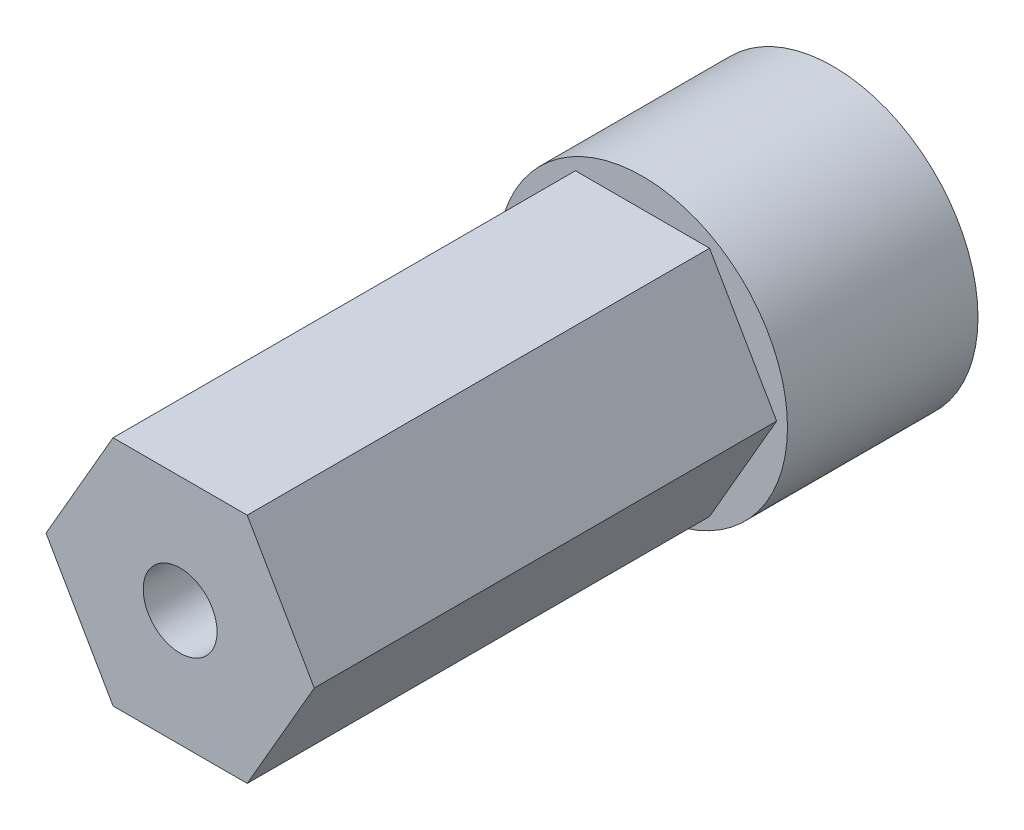
ISO-10303-21;
HEADER;
FILE_DESCRIPTION(('STEP AP214'),'2;1');
FILE_NAME('part.step','',(''),(''),'','','');
FILE_SCHEMA(('AUTOMOTIVE_DESIGN { 1 0 10303 214 1 1 1 1 }'));
ENDSEC;
DATA;
#1=APPLICATION_CONTEXT('core data for automotive mechanical design processes');
#2=APPLICATION_PROTOCOL_DEFINITION('international standard','automotive_design',2000,#1);
#3=PRODUCT_CONTEXT('',#1,'mechanical');
#4=PRODUCT('Part','Part','',(#3));
#5=PRODUCT_RELATED_PRODUCT_CATEGORY('part','',(#4));
#6=PRODUCT_DEFINITION_FORMATION('','',#4);
#7=PRODUCT_DEFINITION_CONTEXT('part definition',#1,'design');
#8=PRODUCT_DEFINITION('design','',#6,#7);
#9=PRODUCT_DEFINITION_SHAPE('','',#8);
#10=(LENGTH_UNIT() NAMED_UNIT(*) SI_UNIT(.MILLI.,.METRE.));
#11=(NAMED_UNIT(*) PLANE_ANGLE_UNIT() SI_UNIT($,.RADIAN.));
#12=(NAMED_UNIT(*) SI_UNIT($,.STERADIAN.) SOLID_ANGLE_UNIT());
#13=UNCERTAINTY_MEASURE_WITH_UNIT(LENGTH_MEASURE(1.E-05),#10,'distance_accuracy_value','');
#14=(GEOMETRIC_REPRESENTATION_CONTEXT(3) GLOBAL_UNCERTAINTY_ASSIGNED_CONTEXT((#13)) GLOBAL_UNIT_ASSIGNED_CONTEXT((#10,
#11,#12)) REPRESENTATION_CONTEXT('',''));
#15=CARTESIAN_POINT('',(0.,0.,0.));
#16=DIRECTION('',(0.,0.,1.));
#17=DIRECTION('',(1.,0.,0.));
#18=AXIS2_PLACEMENT_3D('',#15,#16,#17);
#19=CARTESIAN_POINT('',(0.,0.,10.414));
#20=DIRECTION('',(0.,0.,-1.));
#21=DIRECTION('',(-1.,0.,0.));
#22=AXIS2_PLACEMENT_3D('',#19,#20,#21);
#23=CYLINDRICAL_SURFACE('',#22,7.9248);
#24=CARTESIAN_POINT('',(0.,0.,10.414));
#25=DIRECTION('',(0.,0.,1.));
#26=DIRECTION('',(1.,0.,0.));
#27=AXIS2_PLACEMENT_3D('',#24,#25,#26);
#28=CIRCLE('',#27,7.9248);
#29=CARTESIAN_POINT('',(7.9248,0.,10.414));
#30=VERTEX_POINT('',#29);
#31=EDGE_CURVE('E11',#30,#30,#28,.T.);
#32=ORIENTED_EDGE('',*,*,#31,.F.);
#33=EDGE_LOOP('',(#32));
#34=FACE_BOUND('',#33,.T.);
#35=CARTESIAN_POINT('',(0.,0.,0.));
#36=DIRECTION('',(0.,0.,1.));
#37=DIRECTION('',(1.,0.,0.));
#38=AXIS2_PLACEMENT_3D('',#35,#36,#37);
#39=CIRCLE('',#38,7.9248);
#40=CARTESIAN_POINT('',(7.9248,0.,0.));
#41=VERTEX_POINT('',#40);
#42=EDGE_CURVE('E44',#41,#41,#39,.T.);
#43=ORIENTED_EDGE('',*,*,#42,.T.);
#44=EDGE_LOOP('',(#43));
#45=FACE_BOUND('',#44,.T.);
#46=ADVANCED_FACE('F41',(#34,#45),#23,.T.);
#47=CARTESIAN_POINT('',(0.,0.,10.414));
#48=DIRECTION('',(0.,0.,1.));
#49=DIRECTION('',(1.,0.,0.));
#50=AXIS2_PLACEMENT_3D('',#47,#48,#49);
#51=PLANE('',#50);
#52=DIRECTION('',(1.,0.,0.));
#53=VECTOR('',#52,1.);
#54=CARTESIAN_POINT('',(0.,-6.35,10.414));
#55=LINE('',#54,#53);
#56=CARTESIAN_POINT('',(-3.66617420935412,-6.35,10.414));
#57=VERTEX_POINT('',#56);
#58=CARTESIAN_POINT('',(3.66617420935413,-6.35,10.414));
#59=VERTEX_POINT('',#58);
#60=EDGE_CURVE('E56',#57,#59,#55,.T.);
#61=ORIENTED_EDGE('',*,*,#60,.F.);
#62=DIRECTION('',(0.5,-0.866025403784439,0.));
#63=VECTOR('',#62,1.);
#64=CARTESIAN_POINT('',(-5.49926131403118,-3.175,10.414));
#65=LINE('',#64,#63);
#66=CARTESIAN_POINT('',(-7.33234841870825,0.,10.414));
#67=VERTEX_POINT('',#66);
#68=EDGE_CURVE('E60',#67,#57,#65,.T.);
#69=ORIENTED_EDGE('',*,*,#68,.F.);
#70=DIRECTION('',(-0.5,-0.866025403784439,0.));
#71=VECTOR('',#70,1.);
#72=CARTESIAN_POINT('',(-5.49926131403119,3.175,10.414));
#73=LINE('',#72,#71);
#74=CARTESIAN_POINT('',(-3.66617420935412,6.35,10.414));
#75=VERTEX_POINT('',#74);
#76=EDGE_CURVE('E140',#75,#67,#73,.T.);
#77=ORIENTED_EDGE('',*,*,#76,.F.);
#78=DIRECTION('',(-1.,0.,0.));
#79=VECTOR('',#78,1.);
#80=CARTESIAN_POINT('',(0.,6.35,10.414));
#81=LINE('',#80,#79);
#82=CARTESIAN_POINT('',(3.66617420935412,6.35,10.414));
#83=VERTEX_POINT('',#82);
#84=EDGE_CURVE('E143',#83,#75,#81,.T.);
#85=ORIENTED_EDGE('',*,*,#84,.F.);
#86=DIRECTION('',(-0.5,0.866025403784439,0.));
#87=VECTOR('',#86,1.);
#88=CARTESIAN_POINT('',(5.49926131403119,3.175,10.414));
#89=LINE('',#88,#87);
#90=CARTESIAN_POINT('',(7.33234841870825,0.,10.414));
#91=VERTEX_POINT('',#90);
#92=EDGE_CURVE('E147',#91,#83,#89,.T.);
#93=ORIENTED_EDGE('',*,*,#92,.F.);
#94=DIRECTION('',(0.499999999999999,0.866025403784439,0.));
#95=VECTOR('',#94,1.);
#96=CARTESIAN_POINT('',(5.49926131403119,-3.17499999999999,10.414));
#97=LINE('',#96,#95);
#98=EDGE_CURVE('E151',#59,#91,#97,.T.);
#99=ORIENTED_EDGE('',*,*,#98,.F.);
#100=EDGE_LOOP('',(#61,#69,#77,#85,#93,#99));
#101=FACE_BOUND('',#100,.T.);
#102=ORIENTED_EDGE('',*,*,#31,.T.);
#103=EDGE_LOOP('',(#102));
#104=FACE_BOUND('',#103,.T.);
#105=ADVANCED_FACE('F193',(#101,#104),#51,.T.);
#106=CARTESIAN_POINT('',(0.,0.,0.));
#107=DIRECTION('',(0.,0.,1.));
#108=DIRECTION('',(1.,0.,0.));
#109=AXIS2_PLACEMENT_3D('',#106,#107,#108);
#110=PLANE('',#109);
#111=ORIENTED_EDGE('',*,*,#42,.F.);
#112=EDGE_LOOP('',(#111));
#113=FACE_BOUND('',#112,.T.);
#114=ADVANCED_FACE('F198',(#113),#110,.F.);
#115=CARTESIAN_POINT('',(0.,-6.35,35.687));
#116=DIRECTION('',(0.,1.,0.));
#117=DIRECTION('',(-1.,0.,0.));
#118=AXIS2_PLACEMENT_3D('',#115,#116,#117);
#119=PLANE('',#118);
#120=ORIENTED_EDGE('',*,*,#60,.T.);
#121=DIRECTION('',(0.,0.,-1.));
#122=VECTOR('',#121,1.);
#123=CARTESIAN_POINT('',(3.66617420935413,-6.35,35.687));
#124=LINE('',#123,#122);
#125=CARTESIAN_POINT('',(3.66617420935413,-6.35,35.687));
#126=VERTEX_POINT('',#125);
#127=EDGE_CURVE('E97',#126,#59,#124,.T.);
#128=ORIENTED_EDGE('',*,*,#127,.F.);
#129=DIRECTION('',(1.,0.,0.));
#130=VECTOR('',#129,1.);
#131=CARTESIAN_POINT('',(0.,-6.35,35.687));
#132=LINE('',#131,#130);
#133=CARTESIAN_POINT('',(-3.66617420935412,-6.35,35.687));
#134=VERTEX_POINT('',#133);
#135=EDGE_CURVE('E104',#134,#126,#132,.T.);
#136=ORIENTED_EDGE('',*,*,#135,.F.);
#137=DIRECTION('',(0.,0.,-1.));
#138=VECTOR('',#137,1.);
#139=CARTESIAN_POINT('',(-3.66617420935412,-6.35,35.687));
#140=LINE('',#139,#138);
#141=EDGE_CURVE('E135',#134,#57,#140,.T.);
#142=ORIENTED_EDGE('',*,*,#141,.T.);
#143=EDGE_LOOP('',(#120,#128,#136,#142));
#144=FACE_BOUND('',#143,.T.);
#145=ADVANCED_FACE('F115',(#144),#119,.F.);
#146=CARTESIAN_POINT('',(5.49926131403119,-3.17499999999999,35.687));
#147=DIRECTION('',(-0.866025403784439,0.499999999999999,0.));
#148=DIRECTION('',(-0.499999999999999,-0.866025403784439,0.));
#149=AXIS2_PLACEMENT_3D('',#146,#147,#148);
#150=PLANE('',#149);
#151=ORIENTED_EDGE('',*,*,#98,.T.);
#152=DIRECTION('',(0.,0.,-1.));
#153=VECTOR('',#152,1.);
#154=CARTESIAN_POINT('',(7.33234841870825,0.,35.687));
#155=LINE('',#154,#153);
#156=CARTESIAN_POINT('',(7.33234841870825,0.,35.687));
#157=VERTEX_POINT('',#156);
#158=EDGE_CURVE('E99',#157,#91,#155,.T.);
#159=ORIENTED_EDGE('',*,*,#158,.F.);
#160=DIRECTION('',(0.499999999999999,0.866025403784439,0.));
#161=VECTOR('',#160,1.);
#162=CARTESIAN_POINT('',(5.49926131403119,-3.17499999999999,35.687));
#163=LINE('',#162,#161);
#164=EDGE_CURVE('E92',#126,#157,#163,.T.);
#165=ORIENTED_EDGE('',*,*,#164,.F.);
#166=ORIENTED_EDGE('',*,*,#127,.T.);
#167=EDGE_LOOP('',(#151,#159,#165,#166));
#168=FACE_BOUND('',#167,.T.);
#169=ADVANCED_FACE('F95',(#168),#150,.F.);
#170=CARTESIAN_POINT('',(5.49926131403119,3.175,35.687));
#171=DIRECTION('',(-0.866025403784439,-0.5,0.));
#172=DIRECTION('',(0.5,-0.866025403784439,0.));
#173=AXIS2_PLACEMENT_3D('',#170,#171,#172);
#174=PLANE('',#173);
#175=ORIENTED_EDGE('',*,*,#92,.T.);
#176=DIRECTION('',(0.,0.,-1.));
#177=VECTOR('',#176,1.);
#178=CARTESIAN_POINT('',(3.66617420935412,6.35,35.687));
#179=LINE('',#178,#177);
#180=CARTESIAN_POINT('',(3.66617420935412,6.35,35.687));
#181=VERTEX_POINT('',#180);
#182=EDGE_CURVE('E121',#181,#83,#179,.T.);
#183=ORIENTED_EDGE('',*,*,#182,.F.);
#184=DIRECTION('',(-0.5,0.866025403784439,0.));
#185=VECTOR('',#184,1.);
#186=CARTESIAN_POINT('',(5.49926131403119,3.175,35.687));
#187=LINE('',#186,#185);
#188=EDGE_CURVE('E103',#157,#181,#187,.T.);
#189=ORIENTED_EDGE('',*,*,#188,.F.);
#190=ORIENTED_EDGE('',*,*,#158,.T.);
#191=EDGE_LOOP('',(#175,#183,#189,#190));
#192=FACE_BOUND('',#191,.T.);
#193=ADVANCED_FACE('F212',(#192),#174,.F.);
#194=CARTESIAN_POINT('',(0.,6.35,35.687));
#195=DIRECTION('',(0.,-1.,0.));
#196=DIRECTION('',(1.,0.,0.));
#197=AXIS2_PLACEMENT_3D('',#194,#195,#196);
#198=PLANE('',#197);
#199=ORIENTED_EDGE('',*,*,#84,.T.);
#200=DIRECTION('',(0.,0.,-1.));
#201=VECTOR('',#200,1.);
#202=CARTESIAN_POINT('',(-3.66617420935412,6.35,35.687));
#203=LINE('',#202,#201);
#204=CARTESIAN_POINT('',(-3.66617420935412,6.35,35.687));
#205=VERTEX_POINT('',#204);
#206=EDGE_CURVE('E127',#205,#75,#203,.T.);
#207=ORIENTED_EDGE('',*,*,#206,.F.);
#208=DIRECTION('',(-1.,0.,0.));
#209=VECTOR('',#208,1.);
#210=CARTESIAN_POINT('',(0.,6.35,35.687));
#211=LINE('',#210,#209);
#212=EDGE_CURVE('E162',#181,#205,#211,.T.);
#213=ORIENTED_EDGE('',*,*,#212,.F.);
#214=ORIENTED_EDGE('',*,*,#182,.T.);
#215=EDGE_LOOP('',(#199,#207,#213,#214));
#216=FACE_BOUND('',#215,.T.);
#217=ADVANCED_FACE('F215',(#216),#198,.F.);
#218=CARTESIAN_POINT('',(-5.49926131403119,3.175,35.687));
#219=DIRECTION('',(0.866025403784439,-0.5,0.));
#220=DIRECTION('',(0.5,0.866025403784439,0.));
#221=AXIS2_PLACEMENT_3D('',#218,#219,#220);
#222=PLANE('',#221);
#223=ORIENTED_EDGE('',*,*,#76,.T.);
#224=DIRECTION('',(0.,0.,-1.));
#225=VECTOR('',#224,1.);
#226=CARTESIAN_POINT('',(-7.33234841870825,0.,35.687));
#227=LINE('',#226,#225);
#228=CARTESIAN_POINT('',(-7.33234841870825,0.,35.687));
#229=VERTEX_POINT('',#228);
#230=EDGE_CURVE('E131',#229,#67,#227,.T.);
#231=ORIENTED_EDGE('',*,*,#230,.F.);
#232=DIRECTION('',(-0.5,-0.866025403784439,0.));
#233=VECTOR('',#232,1.);
#234=CARTESIAN_POINT('',(-5.49926131403119,3.175,35.687));
#235=LINE('',#234,#233);
#236=EDGE_CURVE('E159',#205,#229,#235,.T.);
#237=ORIENTED_EDGE('',*,*,#236,.F.);
#238=ORIENTED_EDGE('',*,*,#206,.T.);
#239=EDGE_LOOP('',(#223,#231,#237,#238));
#240=FACE_BOUND('',#239,.T.);
#241=ADVANCED_FACE('F189',(#240),#222,.F.);
#242=CARTESIAN_POINT('',(-5.49926131403118,-3.175,35.687));
#243=DIRECTION('',(0.866025403784438,0.5,0.));
#244=DIRECTION('',(-0.5,0.866025403784439,0.));
#245=AXIS2_PLACEMENT_3D('',#242,#243,#244);
#246=PLANE('',#245);
#247=ORIENTED_EDGE('',*,*,#68,.T.);
#248=ORIENTED_EDGE('',*,*,#141,.F.);
#249=DIRECTION('',(0.5,-0.866025403784439,0.));
#250=VECTOR('',#249,1.);
#251=CARTESIAN_POINT('',(-5.49926131403118,-3.175,35.687));
#252=LINE('',#251,#250);
#253=EDGE_CURVE('E109',#229,#134,#252,.T.);
#254=ORIENTED_EDGE('',*,*,#253,.F.);
#255=ORIENTED_EDGE('',*,*,#230,.T.);
#256=EDGE_LOOP('',(#247,#248,#254,#255));
#257=FACE_BOUND('',#256,.T.);
#258=ADVANCED_FACE('F184',(#257),#246,.F.);
#259=CARTESIAN_POINT('',(0.,0.,35.687));
#260=DIRECTION('',(0.,0.,1.));
#261=DIRECTION('',(1.,0.,0.));
#262=AXIS2_PLACEMENT_3D('',#259,#260,#261);
#263=PLANE('',#262);
#264=CARTESIAN_POINT('',(0.,0.,35.687));
#265=DIRECTION('',(0.,0.,1.));
#266=DIRECTION('',(1.,0.,0.));
#267=AXIS2_PLACEMENT_3D('',#264,#265,#266);
#268=CIRCLE('',#267,2.0193);
#269=CARTESIAN_POINT('',(2.0193,0.,35.687));
#270=VERTEX_POINT('',#269);
#271=EDGE_CURVE('E167',#270,#270,#268,.T.);
#272=ORIENTED_EDGE('',*,*,#271,.F.);
#273=EDGE_LOOP('',(#272));
#274=FACE_BOUND('',#273,.T.);
#275=ORIENTED_EDGE('',*,*,#135,.T.);
#276=ORIENTED_EDGE('',*,*,#164,.T.);
#277=ORIENTED_EDGE('',*,*,#188,.T.);
#278=ORIENTED_EDGE('',*,*,#212,.T.);
#279=ORIENTED_EDGE('',*,*,#236,.T.);
#280=ORIENTED_EDGE('',*,*,#253,.T.);
#281=EDGE_LOOP('',(#275,#276,#277,#278,#279,#280));
#282=FACE_BOUND('',#281,.T.);
#283=ADVANCED_FACE('F107',(#274,#282),#263,.T.);
#284=CARTESIAN_POINT('',(0.,0.,12.827));
#285=DIRECTION('',(0.,0.,1.));
#286=DIRECTION('',(1.,0.,0.));
#287=AXIS2_PLACEMENT_3D('',#284,#285,#286);
#288=CYLINDRICAL_SURFACE('',#287,2.0193);
#289=CARTESIAN_POINT('',(0.,0.,12.827));
#290=DIRECTION('',(0.,0.,1.));
#291=DIRECTION('',(1.,0.,0.));
#292=AXIS2_PLACEMENT_3D('',#289,#290,#291);
#293=CIRCLE('',#292,2.0193);
#294=CARTESIAN_POINT('',(2.0193,0.,12.827));
#295=VERTEX_POINT('',#294);
#296=EDGE_CURVE('E156',#295,#295,#293,.T.);
#297=ORIENTED_EDGE('',*,*,#296,.F.);
#298=EDGE_LOOP('',(#297));
#299=FACE_BOUND('',#298,.T.);
#300=ORIENTED_EDGE('',*,*,#271,.T.);
#301=EDGE_LOOP('',(#300));
#302=FACE_BOUND('',#301,.T.);
#303=ADVANCED_FACE('F177',(#299,#302),#288,.F.);
#304=CARTESIAN_POINT('',(0.,0.,12.827));
#305=DIRECTION('',(0.,0.,1.));
#306=DIRECTION('',(1.,0.,0.));
#307=AXIS2_PLACEMENT_3D('',#304,#305,#306);
#308=PLANE('',#307);
#309=ORIENTED_EDGE('',*,*,#296,.T.);
#310=EDGE_LOOP('',(#309));
#311=FACE_BOUND('',#310,.T.);
#312=ADVANCED_FACE('F175',(#311),#308,.T.);
#313=CLOSED_SHELL('',(#46,#105,#114,#145,#169,#193,#217,#241,#258,#283,#303,#312));
#314=MANIFOLD_SOLID_BREP('B2',#313);
#315=ADVANCED_BREP_SHAPE_REPRESENTATION('',(#18,#314),#14);
#316=SHAPE_DEFINITION_REPRESENTATION(#9,#315);
ENDSEC;
END-ISO-10303-21;
